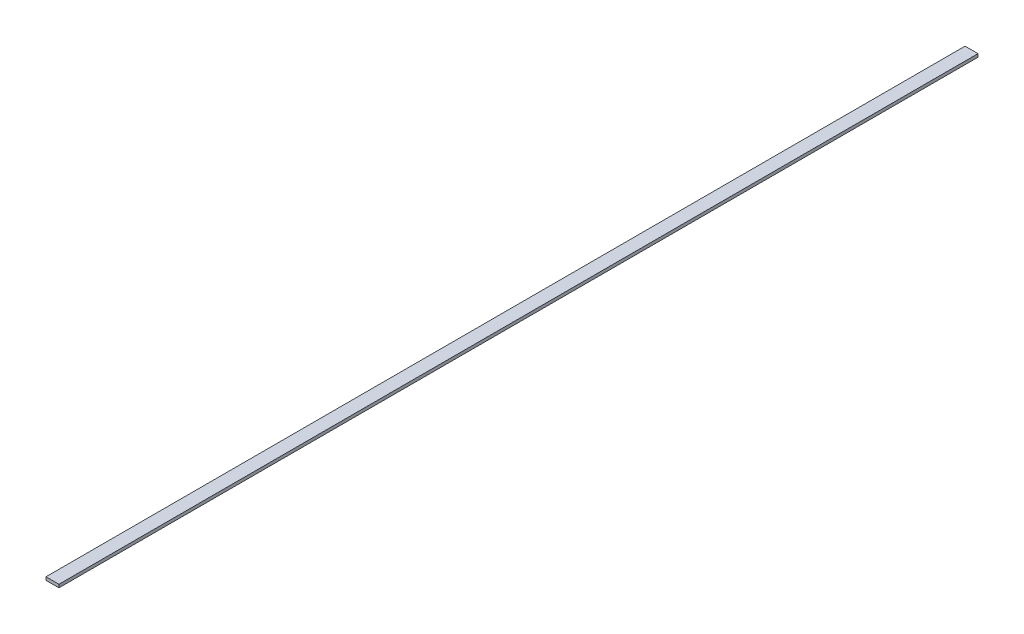
ISO-10303-21;
HEADER;
FILE_DESCRIPTION(('STEP AP214'),'2;1');
FILE_NAME('part.step','',(''),(''),'','','');
FILE_SCHEMA(('AUTOMOTIVE_DESIGN { 1 0 10303 214 1 1 1 1 }'));
ENDSEC;
DATA;
#1=APPLICATION_CONTEXT('core data for automotive mechanical design processes');
#2=APPLICATION_PROTOCOL_DEFINITION('international standard','automotive_design',2000,#1);
#3=PRODUCT_CONTEXT('',#1,'mechanical');
#4=PRODUCT('Part','Part','',(#3));
#5=PRODUCT_RELATED_PRODUCT_CATEGORY('part','',(#4));
#6=PRODUCT_DEFINITION_FORMATION('','',#4);
#7=PRODUCT_DEFINITION_CONTEXT('part definition',#1,'design');
#8=PRODUCT_DEFINITION('design','',#6,#7);
#9=PRODUCT_DEFINITION_SHAPE('','',#8);
#10=(LENGTH_UNIT() NAMED_UNIT(*) SI_UNIT(.MILLI.,.METRE.));
#11=(NAMED_UNIT(*) PLANE_ANGLE_UNIT() SI_UNIT($,.RADIAN.));
#12=(NAMED_UNIT(*) SI_UNIT($,.STERADIAN.) SOLID_ANGLE_UNIT());
#13=UNCERTAINTY_MEASURE_WITH_UNIT(LENGTH_MEASURE(1.E-05),#10,'distance_accuracy_value','');
#14=(GEOMETRIC_REPRESENTATION_CONTEXT(3) GLOBAL_UNCERTAINTY_ASSIGNED_CONTEXT((#13)) GLOBAL_UNIT_ASSIGNED_CONTEXT((#10,
#11,#12)) REPRESENTATION_CONTEXT('',''));
#15=CARTESIAN_POINT('',(0.,0.,0.));
#16=DIRECTION('',(0.,0.,1.));
#17=DIRECTION('',(1.,0.,0.));
#18=AXIS2_PLACEMENT_3D('',#15,#16,#17);
#19=CARTESIAN_POINT('',(0.,1.5,0.));
#20=DIRECTION('',(1.,0.,0.));
#21=DIRECTION('',(0.,0.,-1.));
#22=AXIS2_PLACEMENT_3D('',#19,#20,#21);
#23=PLANE('',#22);
#24=DIRECTION('',(0.,0.,1.));
#25=VECTOR('',#24,1.);
#26=CARTESIAN_POINT('',(0.,0.,0.));
#27=LINE('',#26,#25);
#28=CARTESIAN_POINT('',(0.,0.,-440.));
#29=VERTEX_POINT('',#28);
#30=CARTESIAN_POINT('',(0.,0.,0.));
#31=VERTEX_POINT('',#30);
#32=EDGE_CURVE('E113',#29,#31,#27,.T.);
#33=ORIENTED_EDGE('',*,*,#32,.T.);
#34=DIRECTION('',(0.,-1.,0.));
#35=VECTOR('',#34,1.);
#36=CARTESIAN_POINT('',(0.,1.5,0.));
#37=LINE('',#36,#35);
#38=CARTESIAN_POINT('',(0.,1.5,0.));
#39=VERTEX_POINT('',#38);
#40=EDGE_CURVE('E11',#39,#31,#37,.T.);
#41=ORIENTED_EDGE('',*,*,#40,.F.);
#42=DIRECTION('',(0.,0.,1.));
#43=VECTOR('',#42,1.);
#44=CARTESIAN_POINT('',(0.,1.5,0.));
#45=LINE('',#44,#43);
#46=CARTESIAN_POINT('',(0.,1.5,-440.));
#47=VERTEX_POINT('',#46);
#48=EDGE_CURVE('E96',#47,#39,#45,.T.);
#49=ORIENTED_EDGE('',*,*,#48,.F.);
#50=DIRECTION('',(0.,-1.,0.));
#51=VECTOR('',#50,1.);
#52=CARTESIAN_POINT('',(0.,1.5,-440.));
#53=LINE('',#52,#51);
#54=EDGE_CURVE('E109',#47,#29,#53,.T.);
#55=ORIENTED_EDGE('',*,*,#54,.T.);
#56=EDGE_LOOP('',(#33,#41,#49,#55));
#57=FACE_BOUND('',#56,.T.);
#58=ADVANCED_FACE('F40',(#57),#23,.F.);
#59=CARTESIAN_POINT('',(0.,1.5,0.));
#60=DIRECTION('',(0.,0.,-1.));
#61=DIRECTION('',(-1.,0.,0.));
#62=AXIS2_PLACEMENT_3D('',#59,#60,#61);
#63=PLANE('',#62);
#64=DIRECTION('',(1.,0.,0.));
#65=VECTOR('',#64,1.);
#66=CARTESIAN_POINT('',(0.,0.,0.));
#67=LINE('',#66,#65);
#68=CARTESIAN_POINT('',(6.2,0.,0.));
#69=VERTEX_POINT('',#68);
#70=EDGE_CURVE('E101',#31,#69,#67,.T.);
#71=ORIENTED_EDGE('',*,*,#70,.T.);
#72=DIRECTION('',(0.,-1.,0.));
#73=VECTOR('',#72,1.);
#74=CARTESIAN_POINT('',(6.2,1.5,0.));
#75=LINE('',#74,#73);
#76=CARTESIAN_POINT('',(6.2,1.5,0.));
#77=VERTEX_POINT('',#76);
#78=EDGE_CURVE('E49',#77,#69,#75,.T.);
#79=ORIENTED_EDGE('',*,*,#78,.F.);
#80=DIRECTION('',(1.,0.,0.));
#81=VECTOR('',#80,1.);
#82=CARTESIAN_POINT('',(0.,1.5,0.));
#83=LINE('',#82,#81);
#84=EDGE_CURVE('E90',#39,#77,#83,.T.);
#85=ORIENTED_EDGE('',*,*,#84,.F.);
#86=ORIENTED_EDGE('',*,*,#40,.T.);
#87=EDGE_LOOP('',(#71,#79,#85,#86));
#88=FACE_BOUND('',#87,.T.);
#89=ADVANCED_FACE('F100',(#88),#63,.F.);
#90=CARTESIAN_POINT('',(6.2,1.5,0.));
#91=DIRECTION('',(-1.,0.,0.));
#92=DIRECTION('',(0.,0.,1.));
#93=AXIS2_PLACEMENT_3D('',#90,#91,#92);
#94=PLANE('',#93);
#95=DIRECTION('',(0.,0.,-1.));
#96=VECTOR('',#95,1.);
#97=CARTESIAN_POINT('',(6.2,0.,0.));
#98=LINE('',#97,#96);
#99=CARTESIAN_POINT('',(6.2,0.,-440.));
#100=VERTEX_POINT('',#99);
#101=EDGE_CURVE('E76',#69,#100,#98,.T.);
#102=ORIENTED_EDGE('',*,*,#101,.T.);
#103=DIRECTION('',(0.,-1.,0.));
#104=VECTOR('',#103,1.);
#105=CARTESIAN_POINT('',(6.2,1.5,-440.));
#106=LINE('',#105,#104);
#107=CARTESIAN_POINT('',(6.2,1.5,-440.));
#108=VERTEX_POINT('',#107);
#109=EDGE_CURVE('E103',#108,#100,#106,.T.);
#110=ORIENTED_EDGE('',*,*,#109,.F.);
#111=DIRECTION('',(0.,0.,-1.));
#112=VECTOR('',#111,1.);
#113=CARTESIAN_POINT('',(6.2,1.5,0.));
#114=LINE('',#113,#112);
#115=EDGE_CURVE('E94',#77,#108,#114,.T.);
#116=ORIENTED_EDGE('',*,*,#115,.F.);
#117=ORIENTED_EDGE('',*,*,#78,.T.);
#118=EDGE_LOOP('',(#102,#110,#116,#117));
#119=FACE_BOUND('',#118,.T.);
#120=ADVANCED_FACE('F104',(#119),#94,.F.);
#121=CARTESIAN_POINT('',(0.,1.5,-440.));
#122=DIRECTION('',(0.,0.,1.));
#123=DIRECTION('',(1.,0.,0.));
#124=AXIS2_PLACEMENT_3D('',#121,#122,#123);
#125=PLANE('',#124);
#126=DIRECTION('',(-1.,0.,0.));
#127=VECTOR('',#126,1.);
#128=CARTESIAN_POINT('',(0.,0.,-440.));
#129=LINE('',#128,#127);
#130=EDGE_CURVE('E82',#100,#29,#129,.T.);
#131=ORIENTED_EDGE('',*,*,#130,.T.);
#132=ORIENTED_EDGE('',*,*,#54,.F.);
#133=DIRECTION('',(-1.,0.,0.));
#134=VECTOR('',#133,1.);
#135=CARTESIAN_POINT('',(0.,1.5,-440.));
#136=LINE('',#135,#134);
#137=EDGE_CURVE('E57',#108,#47,#136,.T.);
#138=ORIENTED_EDGE('',*,*,#137,.F.);
#139=ORIENTED_EDGE('',*,*,#109,.T.);
#140=EDGE_LOOP('',(#131,#132,#138,#139));
#141=FACE_BOUND('',#140,.T.);
#142=ADVANCED_FACE('F122',(#141),#125,.F.);
#143=CARTESIAN_POINT('',(0.,1.5,0.));
#144=DIRECTION('',(0.,-1.,0.));
#145=DIRECTION('',(0.,0.,-1.));
#146=AXIS2_PLACEMENT_3D('',#143,#144,#145);
#147=PLANE('',#146);
#148=ORIENTED_EDGE('',*,*,#48,.T.);
#149=ORIENTED_EDGE('',*,*,#84,.T.);
#150=ORIENTED_EDGE('',*,*,#115,.T.);
#151=ORIENTED_EDGE('',*,*,#137,.T.);
#152=EDGE_LOOP('',(#148,#149,#150,#151));
#153=FACE_BOUND('',#152,.T.);
#154=ADVANCED_FACE('F92',(#153),#147,.F.);
#155=CARTESIAN_POINT('',(0.,0.,0.));
#156=DIRECTION('',(0.,-1.,0.));
#157=DIRECTION('',(0.,0.,-1.));
#158=AXIS2_PLACEMENT_3D('',#155,#156,#157);
#159=PLANE('',#158);
#160=ORIENTED_EDGE('',*,*,#32,.F.);
#161=ORIENTED_EDGE('',*,*,#130,.F.);
#162=ORIENTED_EDGE('',*,*,#101,.F.);
#163=ORIENTED_EDGE('',*,*,#70,.F.);
#164=EDGE_LOOP('',(#160,#161,#162,#163));
#165=FACE_BOUND('',#164,.T.);
#166=ADVANCED_FACE('F125',(#165),#159,.T.);
#167=CLOSED_SHELL('',(#58,#89,#120,#142,#154,#166));
#168=MANIFOLD_SOLID_BREP('B2',#167);
#169=ADVANCED_BREP_SHAPE_REPRESENTATION('',(#18,#168),#14);
#170=SHAPE_DEFINITION_REPRESENTATION(#9,#169);
ENDSEC;
END-ISO-10303-21;
